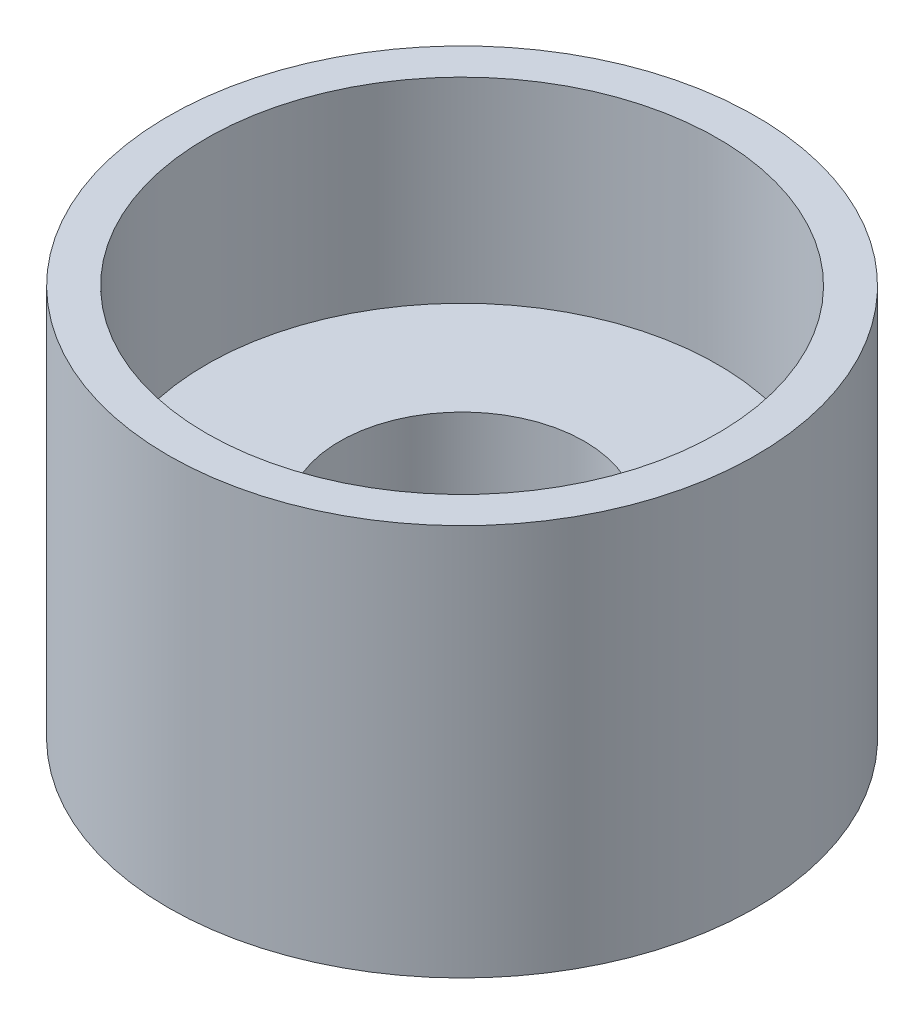
ISO-10303-21;
HEADER;
FILE_DESCRIPTION(('STEP AP214'),'2;1');
FILE_NAME('part.step','',(''),(''),'','','');
FILE_SCHEMA(('AUTOMOTIVE_DESIGN { 1 0 10303 214 1 1 1 1 }'));
ENDSEC;
DATA;
#1=APPLICATION_CONTEXT('core data for automotive mechanical design processes');
#2=APPLICATION_PROTOCOL_DEFINITION('international standard','automotive_design',2000,#1);
#3=PRODUCT_CONTEXT('',#1,'mechanical');
#4=PRODUCT('Part','Part','',(#3));
#5=PRODUCT_RELATED_PRODUCT_CATEGORY('part','',(#4));
#6=PRODUCT_DEFINITION_FORMATION('','',#4);
#7=PRODUCT_DEFINITION_CONTEXT('part definition',#1,'design');
#8=PRODUCT_DEFINITION('design','',#6,#7);
#9=PRODUCT_DEFINITION_SHAPE('','',#8);
#10=(LENGTH_UNIT() NAMED_UNIT(*) SI_UNIT(.MILLI.,.METRE.));
#11=(NAMED_UNIT(*) PLANE_ANGLE_UNIT() SI_UNIT($,.RADIAN.));
#12=(NAMED_UNIT(*) SI_UNIT($,.STERADIAN.) SOLID_ANGLE_UNIT());
#13=UNCERTAINTY_MEASURE_WITH_UNIT(LENGTH_MEASURE(1.E-05),#10,'distance_accuracy_value','');
#14=(GEOMETRIC_REPRESENTATION_CONTEXT(3) GLOBAL_UNCERTAINTY_ASSIGNED_CONTEXT((#13)) GLOBAL_UNIT_ASSIGNED_CONTEXT((#10,
#11,#12)) REPRESENTATION_CONTEXT('',''));
#15=CARTESIAN_POINT('',(0.,0.,0.));
#16=DIRECTION('',(0.,0.,1.));
#17=DIRECTION('',(1.,0.,0.));
#18=AXIS2_PLACEMENT_3D('',#15,#16,#17);
#19=CARTESIAN_POINT('',(0.,50.8,0.));
#20=DIRECTION('',(0.,-1.,0.));
#21=DIRECTION('',(0.,0.,-1.));
#22=AXIS2_PLACEMENT_3D('',#19,#20,#21);
#23=CYLINDRICAL_SURFACE('',#22,38.1);
#24=CARTESIAN_POINT('',(0.,50.8,0.));
#25=DIRECTION('',(0.,1.,0.));
#26=DIRECTION('',(0.,0.,1.));
#27=AXIS2_PLACEMENT_3D('',#24,#25,#26);
#28=CIRCLE('',#27,38.1);
#29=CARTESIAN_POINT('',(0.,50.8,38.1));
#30=VERTEX_POINT('',#29);
#31=EDGE_CURVE('E10',#30,#30,#28,.T.);
#32=ORIENTED_EDGE('',*,*,#31,.F.);
#33=EDGE_LOOP('',(#32));
#34=FACE_BOUND('',#33,.T.);
#35=CARTESIAN_POINT('',(0.,0.,0.));
#36=DIRECTION('',(0.,1.,0.));
#37=DIRECTION('',(0.,0.,1.));
#38=AXIS2_PLACEMENT_3D('',#35,#36,#37);
#39=CIRCLE('',#38,38.1);
#40=CARTESIAN_POINT('',(0.,0.,38.1));
#41=VERTEX_POINT('',#40);
#42=EDGE_CURVE('E38',#41,#41,#39,.T.);
#43=ORIENTED_EDGE('',*,*,#42,.T.);
#44=EDGE_LOOP('',(#43));
#45=FACE_BOUND('',#44,.T.);
#46=ADVANCED_FACE('F35',(#34,#45),#23,.T.);
#47=CARTESIAN_POINT('',(0.,50.8,0.));
#48=DIRECTION('',(0.,1.,0.));
#49=DIRECTION('',(0.,0.,1.));
#50=AXIS2_PLACEMENT_3D('',#47,#48,#49);
#51=PLANE('',#50);
#52=CARTESIAN_POINT('',(0.,50.8,0.));
#53=DIRECTION('',(0.,1.,0.));
#54=DIRECTION('',(0.,0.,1.));
#55=AXIS2_PLACEMENT_3D('',#52,#53,#54);
#56=CIRCLE('',#55,33.147);
#57=CARTESIAN_POINT('',(0.,50.8,33.147));
#58=VERTEX_POINT('',#57);
#59=EDGE_CURVE('E50',#58,#58,#56,.T.);
#60=ORIENTED_EDGE('',*,*,#59,.F.);
#61=EDGE_LOOP('',(#60));
#62=FACE_BOUND('',#61,.T.);
#63=ORIENTED_EDGE('',*,*,#31,.T.);
#64=EDGE_LOOP('',(#63));
#65=FACE_BOUND('',#64,.T.);
#66=ADVANCED_FACE('F72',(#62,#65),#51,.T.);
#67=CARTESIAN_POINT('',(0.,0.,0.));
#68=DIRECTION('',(0.,1.,0.));
#69=DIRECTION('',(0.,0.,1.));
#70=AXIS2_PLACEMENT_3D('',#67,#68,#69);
#71=PLANE('',#70);
#72=CARTESIAN_POINT('',(0.,0.,0.));
#73=DIRECTION('',(0.,-1.,0.));
#74=DIRECTION('',(0.,0.,-1.));
#75=AXIS2_PLACEMENT_3D('',#72,#73,#74);
#76=CIRCLE('',#75,9.525);
#77=CARTESIAN_POINT('',(0.,0.,-9.525));
#78=VERTEX_POINT('',#77);
#79=EDGE_CURVE('E61',#78,#78,#76,.T.);
#80=ORIENTED_EDGE('',*,*,#79,.F.);
#81=EDGE_LOOP('',(#80));
#82=FACE_BOUND('',#81,.T.);
#83=ORIENTED_EDGE('',*,*,#42,.F.);
#84=EDGE_LOOP('',(#83));
#85=FACE_BOUND('',#84,.T.);
#86=ADVANCED_FACE('F68',(#82,#85),#71,.F.);
#87=CARTESIAN_POINT('',(0.,25.4,0.));
#88=DIRECTION('',(0.,1.,0.));
#89=DIRECTION('',(0.,0.,1.));
#90=AXIS2_PLACEMENT_3D('',#87,#88,#89);
#91=CYLINDRICAL_SURFACE('',#90,33.147);
#92=CARTESIAN_POINT('',(0.,25.4,0.));
#93=DIRECTION('',(0.,1.,0.));
#94=DIRECTION('',(0.,0.,1.));
#95=AXIS2_PLACEMENT_3D('',#92,#93,#94);
#96=CIRCLE('',#95,33.147);
#97=CARTESIAN_POINT('',(0.,25.4,33.147));
#98=VERTEX_POINT('',#97);
#99=EDGE_CURVE('E49',#98,#98,#96,.T.);
#100=ORIENTED_EDGE('',*,*,#99,.F.);
#101=EDGE_LOOP('',(#100));
#102=FACE_BOUND('',#101,.T.);
#103=ORIENTED_EDGE('',*,*,#59,.T.);
#104=EDGE_LOOP('',(#103));
#105=FACE_BOUND('',#104,.T.);
#106=ADVANCED_FACE('F71',(#102,#105),#91,.F.);
#107=CARTESIAN_POINT('',(0.,25.4,0.));
#108=DIRECTION('',(0.,1.,0.));
#109=DIRECTION('',(0.,0.,1.));
#110=AXIS2_PLACEMENT_3D('',#107,#108,#109);
#111=PLANE('',#110);
#112=CARTESIAN_POINT('',(0.,25.4,0.));
#113=DIRECTION('',(0.,1.,0.));
#114=DIRECTION('',(0.,0.,1.));
#115=AXIS2_PLACEMENT_3D('',#112,#113,#114);
#116=CIRCLE('',#115,15.875);
#117=CARTESIAN_POINT('',(0.,25.4,15.875));
#118=VERTEX_POINT('',#117);
#119=EDGE_CURVE('E53',#118,#118,#116,.T.);
#120=ORIENTED_EDGE('',*,*,#119,.F.);
#121=EDGE_LOOP('',(#120));
#122=FACE_BOUND('',#121,.T.);
#123=ORIENTED_EDGE('',*,*,#99,.T.);
#124=EDGE_LOOP('',(#123));
#125=FACE_BOUND('',#124,.T.);
#126=ADVANCED_FACE('F93',(#122,#125),#111,.T.);
#127=CARTESIAN_POINT('',(0.,3.048,0.));
#128=DIRECTION('',(0.,1.,0.));
#129=DIRECTION('',(0.,0.,1.));
#130=AXIS2_PLACEMENT_3D('',#127,#128,#129);
#131=PLANE('',#130);
#132=CARTESIAN_POINT('',(0.,3.048,0.));
#133=DIRECTION('',(0.,1.,0.));
#134=DIRECTION('',(0.,0.,1.));
#135=AXIS2_PLACEMENT_3D('',#132,#133,#134);
#136=CIRCLE('',#135,9.525);
#137=CARTESIAN_POINT('',(0.,3.048,9.525));
#138=VERTEX_POINT('',#137);
#139=EDGE_CURVE('E58',#138,#138,#136,.F.);
#140=ORIENTED_EDGE('',*,*,#139,.T.);
#141=EDGE_LOOP('',(#140));
#142=FACE_BOUND('',#141,.T.);
#143=CARTESIAN_POINT('',(0.,3.048,0.));
#144=DIRECTION('',(0.,1.,0.));
#145=DIRECTION('',(0.,0.,1.));
#146=AXIS2_PLACEMENT_3D('',#143,#144,#145);
#147=CIRCLE('',#146,15.875);
#148=CARTESIAN_POINT('',(0.,3.048,15.875));
#149=VERTEX_POINT('',#148);
#150=EDGE_CURVE('E45',#149,#149,#147,.T.);
#151=ORIENTED_EDGE('',*,*,#150,.T.);
#152=EDGE_LOOP('',(#151));
#153=FACE_BOUND('',#152,.T.);
#154=ADVANCED_FACE('F89',(#142,#153),#131,.T.);
#155=CARTESIAN_POINT('',(0.,3.048,0.));
#156=DIRECTION('',(0.,1.,0.));
#157=DIRECTION('',(0.,0.,1.));
#158=AXIS2_PLACEMENT_3D('',#155,#156,#157);
#159=CYLINDRICAL_SURFACE('',#158,15.875);
#160=ORIENTED_EDGE('',*,*,#150,.F.);
#161=EDGE_LOOP('',(#160));
#162=FACE_BOUND('',#161,.T.);
#163=ORIENTED_EDGE('',*,*,#119,.T.);
#164=EDGE_LOOP('',(#163));
#165=FACE_BOUND('',#164,.T.);
#166=ADVANCED_FACE('F86',(#162,#165),#159,.F.);
#167=CARTESIAN_POINT('',(0.,29.9887683632075,0.));
#168=DIRECTION('',(0.,-1.,0.));
#169=DIRECTION('',(0.,0.,-1.));
#170=AXIS2_PLACEMENT_3D('',#167,#168,#169);
#171=CYLINDRICAL_SURFACE('',#170,9.525);
#172=ORIENTED_EDGE('',*,*,#79,.T.);
#173=EDGE_LOOP('',(#172));
#174=FACE_BOUND('',#173,.T.);
#175=ORIENTED_EDGE('',*,*,#139,.F.);
#176=EDGE_LOOP('',(#175));
#177=FACE_BOUND('',#176,.T.);
#178=ADVANCED_FACE('F65',(#174,#177),#171,.F.);
#179=CLOSED_SHELL('',(#46,#66,#86,#106,#126,#154,#166,#178));
#180=MANIFOLD_SOLID_BREP('B2',#179);
#181=ADVANCED_BREP_SHAPE_REPRESENTATION('',(#18,#180),#14);
#182=SHAPE_DEFINITION_REPRESENTATION(#9,#181);
ENDSEC;
END-ISO-10303-21;
